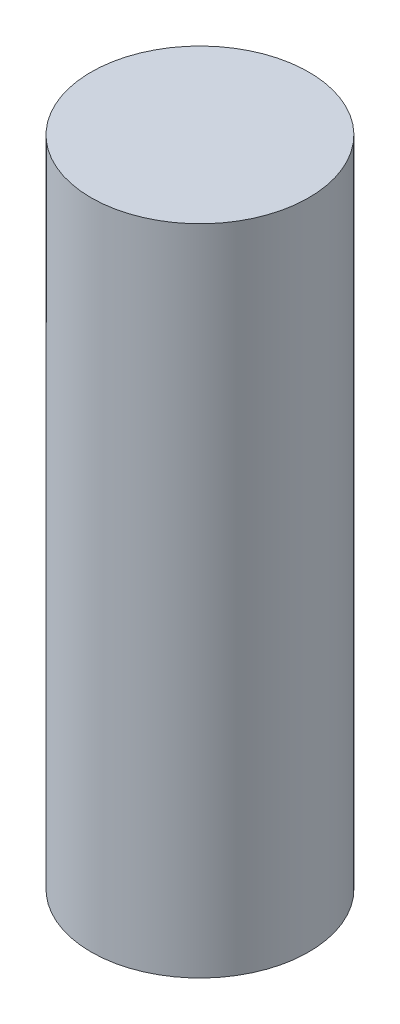
ISO-10303-21;
HEADER;
FILE_DESCRIPTION(('STEP AP214'),'2;1');
FILE_NAME('part.step','',(''),(''),'','','');
FILE_SCHEMA(('AUTOMOTIVE_DESIGN { 1 0 10303 214 1 1 1 1 }'));
ENDSEC;
DATA;
#1=APPLICATION_CONTEXT('core data for automotive mechanical design processes');
#2=APPLICATION_PROTOCOL_DEFINITION('international standard','automotive_design',2000,#1);
#3=PRODUCT_CONTEXT('',#1,'mechanical');
#4=PRODUCT('Part','Part','',(#3));
#5=PRODUCT_RELATED_PRODUCT_CATEGORY('part','',(#4));
#6=PRODUCT_DEFINITION_FORMATION('','',#4);
#7=PRODUCT_DEFINITION_CONTEXT('part definition',#1,'design');
#8=PRODUCT_DEFINITION('design','',#6,#7);
#9=PRODUCT_DEFINITION_SHAPE('','',#8);
#10=(LENGTH_UNIT() NAMED_UNIT(*) SI_UNIT(.MILLI.,.METRE.));
#11=(NAMED_UNIT(*) PLANE_ANGLE_UNIT() SI_UNIT($,.RADIAN.));
#12=(NAMED_UNIT(*) SI_UNIT($,.STERADIAN.) SOLID_ANGLE_UNIT());
#13=UNCERTAINTY_MEASURE_WITH_UNIT(LENGTH_MEASURE(1.E-05),#10,'distance_accuracy_value','');
#14=(GEOMETRIC_REPRESENTATION_CONTEXT(3) GLOBAL_UNCERTAINTY_ASSIGNED_CONTEXT((#13)) GLOBAL_UNIT_ASSIGNED_CONTEXT((#10,
#11,#12)) REPRESENTATION_CONTEXT('',''));
#15=CARTESIAN_POINT('',(0.,0.,0.));
#16=DIRECTION('',(0.,0.,1.));
#17=DIRECTION('',(1.,0.,0.));
#18=AXIS2_PLACEMENT_3D('',#15,#16,#17);
#19=CARTESIAN_POINT('',(0.,15.,0.));
#20=DIRECTION('',(0.,-1.,0.));
#21=DIRECTION('',(0.,0.,-1.));
#22=AXIS2_PLACEMENT_3D('',#19,#20,#21);
#23=CYLINDRICAL_SURFACE('',#22,5.);
#24=CARTESIAN_POINT('',(0.,15.,0.));
#25=DIRECTION('',(0.,1.,0.));
#26=DIRECTION('',(0.,0.,1.));
#27=AXIS2_PLACEMENT_3D('',#24,#25,#26);
#28=CIRCLE('',#27,5.);
#29=CARTESIAN_POINT('',(0.,15.,5.));
#30=VERTEX_POINT('',#29);
#31=EDGE_CURVE('E10',#30,#30,#28,.T.);
#32=ORIENTED_EDGE('',*,*,#31,.F.);
#33=EDGE_LOOP('',(#32));
#34=FACE_BOUND('',#33,.T.);
#35=CARTESIAN_POINT('',(0.,-15.,0.));
#36=DIRECTION('',(0.,1.,0.));
#37=DIRECTION('',(0.,0.,1.));
#38=AXIS2_PLACEMENT_3D('',#35,#36,#37);
#39=CIRCLE('',#38,5.);
#40=CARTESIAN_POINT('',(0.,-15.,5.));
#41=VERTEX_POINT('',#40);
#42=EDGE_CURVE('E40',#41,#41,#39,.T.);
#43=ORIENTED_EDGE('',*,*,#42,.T.);
#44=EDGE_LOOP('',(#43));
#45=FACE_BOUND('',#44,.T.);
#46=ADVANCED_FACE('F37',(#34,#45),#23,.T.);
#47=CARTESIAN_POINT('',(0.,15.,0.));
#48=DIRECTION('',(0.,1.,0.));
#49=DIRECTION('',(0.,0.,1.));
#50=AXIS2_PLACEMENT_3D('',#47,#48,#49);
#51=PLANE('',#50);
#52=ORIENTED_EDGE('',*,*,#31,.T.);
#53=EDGE_LOOP('',(#52));
#54=FACE_BOUND('',#53,.T.);
#55=ADVANCED_FACE('F54',(#54),#51,.T.);
#56=CARTESIAN_POINT('',(0.,-15.,0.));
#57=DIRECTION('',(0.,1.,0.));
#58=DIRECTION('',(0.,0.,1.));
#59=AXIS2_PLACEMENT_3D('',#56,#57,#58);
#60=PLANE('',#59);
#61=ORIENTED_EDGE('',*,*,#42,.F.);
#62=EDGE_LOOP('',(#61));
#63=FACE_BOUND('',#62,.T.);
#64=ADVANCED_FACE('F52',(#63),#60,.F.);
#65=CLOSED_SHELL('',(#46,#55,#64));
#66=MANIFOLD_SOLID_BREP('B2',#65);
#67=ADVANCED_BREP_SHAPE_REPRESENTATION('',(#18,#66),#14);
#68=SHAPE_DEFINITION_REPRESENTATION(#9,#67);
ENDSEC;
END-ISO-10303-21;
